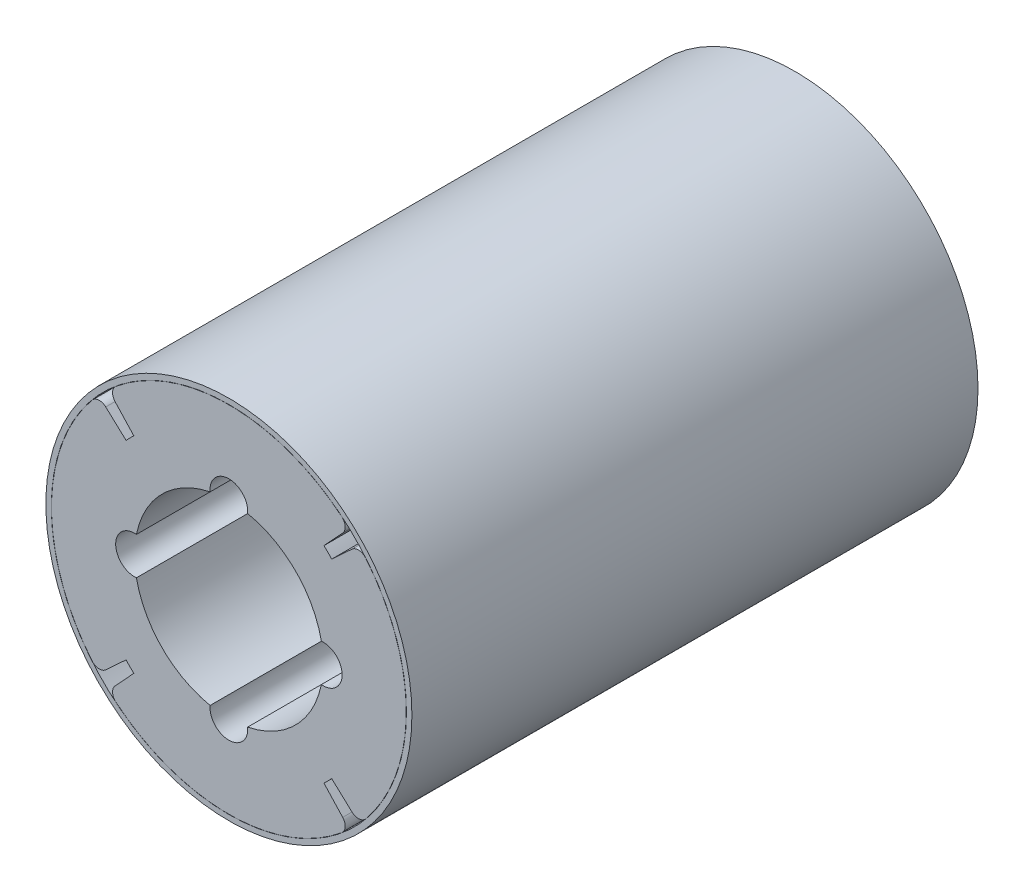
ISO-10303-21;
HEADER;
FILE_DESCRIPTION(('STEP AP214'),'2;1');
FILE_NAME('part.step','',(''),(''),'','','');
FILE_SCHEMA(('AUTOMOTIVE_DESIGN { 1 0 10303 214 1 1 1 1 }'));
ENDSEC;
DATA;
#1=APPLICATION_CONTEXT('core data for automotive mechanical design processes');
#2=APPLICATION_PROTOCOL_DEFINITION('international standard','automotive_design',2000,#1);
#3=PRODUCT_CONTEXT('',#1,'mechanical');
#4=PRODUCT('Part','Part','',(#3));
#5=PRODUCT_RELATED_PRODUCT_CATEGORY('part','',(#4));
#6=PRODUCT_DEFINITION_FORMATION('','',#4);
#7=PRODUCT_DEFINITION_CONTEXT('part definition',#1,'design');
#8=PRODUCT_DEFINITION('design','',#6,#7);
#9=PRODUCT_DEFINITION_SHAPE('','',#8);
#10=(LENGTH_UNIT() NAMED_UNIT(*) SI_UNIT(.MILLI.,.METRE.));
#11=(NAMED_UNIT(*) PLANE_ANGLE_UNIT() SI_UNIT($,.RADIAN.));
#12=(NAMED_UNIT(*) SI_UNIT($,.STERADIAN.) SOLID_ANGLE_UNIT());
#13=UNCERTAINTY_MEASURE_WITH_UNIT(LENGTH_MEASURE(1.E-05),#10,'distance_accuracy_value','');
#14=(GEOMETRIC_REPRESENTATION_CONTEXT(3) GLOBAL_UNCERTAINTY_ASSIGNED_CONTEXT((#13)) GLOBAL_UNIT_ASSIGNED_CONTEXT((#10,
#11,#12)) REPRESENTATION_CONTEXT('',''));
#15=CARTESIAN_POINT('',(0.,0.,0.));
#16=DIRECTION('',(0.,0.,1.));
#17=DIRECTION('',(1.,0.,0.));
#18=AXIS2_PLACEMENT_3D('',#15,#16,#17);
#19=CARTESIAN_POINT('',(0.,0.,30.));
#20=DIRECTION('',(0.,0.,1.));
#21=DIRECTION('',(1.,0.,0.));
#22=AXIS2_PLACEMENT_3D('',#19,#20,#21);
#23=PLANE('',#22);
#24=CARTESIAN_POINT('',(0.,0.,30.));
#25=DIRECTION('',(0.,0.,1.));
#26=DIRECTION('',(1.,0.,0.));
#27=AXIS2_PLACEMENT_3D('',#24,#25,#26);
#28=CIRCLE('',#27,9.7);
#29=CARTESIAN_POINT('',(9.7,0.,30.));
#30=VERTEX_POINT('',#29);
#31=EDGE_CURVE('E11',#30,#30,#28,.T.);
#32=ORIENTED_EDGE('',*,*,#31,.T.);
#33=EDGE_LOOP('',(#32));
#34=FACE_BOUND('',#33,.T.);
#35=CARTESIAN_POINT('',(0.,0.,30.));
#36=DIRECTION('',(0.,0.,1.));
#37=DIRECTION('',(1.,0.,0.));
#38=AXIS2_PLACEMENT_3D('',#35,#36,#37);
#39=CIRCLE('',#38,9.41);
#40=CARTESIAN_POINT('',(9.41,0.,30.));
#41=VERTEX_POINT('',#40);
#42=EDGE_CURVE('E57',#41,#41,#39,.T.);
#43=ORIENTED_EDGE('',*,*,#42,.F.);
#44=EDGE_LOOP('',(#43));
#45=FACE_BOUND('',#44,.T.);
#46=ADVANCED_FACE('F46',(#34,#45),#23,.T.);
#47=CARTESIAN_POINT('',(0.,0.,0.));
#48=DIRECTION('',(0.,0.,1.));
#49=DIRECTION('',(1.,0.,0.));
#50=AXIS2_PLACEMENT_3D('',#47,#48,#49);
#51=PLANE('',#50);
#52=CARTESIAN_POINT('',(0.,0.,0.));
#53=DIRECTION('',(0.,0.,1.));
#54=DIRECTION('',(1.,0.,0.));
#55=AXIS2_PLACEMENT_3D('',#52,#53,#54);
#56=CIRCLE('',#55,9.7);
#57=CARTESIAN_POINT('',(9.7,0.,0.));
#58=VERTEX_POINT('',#57);
#59=EDGE_CURVE('E50',#58,#58,#56,.T.);
#60=ORIENTED_EDGE('',*,*,#59,.F.);
#61=EDGE_LOOP('',(#60));
#62=FACE_BOUND('',#61,.T.);
#63=CARTESIAN_POINT('',(0.,0.,0.));
#64=DIRECTION('',(0.,0.,1.));
#65=DIRECTION('',(1.,0.,0.));
#66=AXIS2_PLACEMENT_3D('',#63,#64,#65);
#67=CIRCLE('',#66,9.41);
#68=CARTESIAN_POINT('',(9.41,0.,0.));
#69=VERTEX_POINT('',#68);
#70=EDGE_CURVE('E59',#69,#69,#67,.T.);
#71=ORIENTED_EDGE('',*,*,#70,.T.);
#72=EDGE_LOOP('',(#71));
#73=FACE_BOUND('',#72,.T.);
#74=ADVANCED_FACE('F69',(#62,#73),#51,.F.);
#75=CARTESIAN_POINT('',(0.,0.,30.));
#76=DIRECTION('',(0.,0.,-1.));
#77=DIRECTION('',(-1.,0.,0.));
#78=AXIS2_PLACEMENT_3D('',#75,#76,#77);
#79=CYLINDRICAL_SURFACE('',#78,9.7);
#80=ORIENTED_EDGE('',*,*,#31,.F.);
#81=EDGE_LOOP('',(#80));
#82=FACE_BOUND('',#81,.T.);
#83=ORIENTED_EDGE('',*,*,#59,.T.);
#84=EDGE_LOOP('',(#83));
#85=FACE_BOUND('',#84,.T.);
#86=ADVANCED_FACE('F48',(#82,#85),#79,.T.);
#87=CARTESIAN_POINT('',(0.,0.,30.));
#88=DIRECTION('',(0.,0.,-1.));
#89=DIRECTION('',(-1.,0.,0.));
#90=AXIS2_PLACEMENT_3D('',#87,#88,#89);
#91=CYLINDRICAL_SURFACE('',#90,9.41);
#92=ORIENTED_EDGE('',*,*,#42,.T.);
#93=EDGE_LOOP('',(#92));
#94=FACE_BOUND('',#93,.T.);
#95=ORIENTED_EDGE('',*,*,#70,.F.);
#96=EDGE_LOOP('',(#95));
#97=FACE_BOUND('',#96,.T.);
#98=ADVANCED_FACE('F65',(#94,#97),#91,.F.);
#99=CLOSED_SHELL('',(#46,#74,#86,#98));
#100=MANIFOLD_SOLID_BREP('B2',#99);
#101=CARTESIAN_POINT('',(0.,0.,30.));
#102=DIRECTION('',(0.,0.,-1.));
#103=DIRECTION('',(-1.,0.,0.));
#104=AXIS2_PLACEMENT_3D('',#101,#102,#103);
#105=CYLINDRICAL_SURFACE('',#104,5.);
#106=CARTESIAN_POINT('',(0.,0.,30.));
#107=DIRECTION('',(0.,0.,1.));
#108=DIRECTION('',(1.,0.,0.));
#109=AXIS2_PLACEMENT_3D('',#106,#107,#108);
#110=CIRCLE('',#109,5.);
#111=CARTESIAN_POINT('',(-0.99498743710662,4.9,30.));
#112=VERTEX_POINT('',#111);
#113=CARTESIAN_POINT('',(-4.9,0.994987437106603,30.));
#114=VERTEX_POINT('',#113);
#115=EDGE_CURVE('E348',#112,#114,#110,.T.);
#116=ORIENTED_EDGE('',*,*,#115,.T.);
#117=DIRECTION('',(0.,0.,-1.));
#118=VECTOR('',#117,1.);
#119=CARTESIAN_POINT('',(-4.9,0.994987437106603,15.));
#120=LINE('',#119,#118);
#121=CARTESIAN_POINT('',(-4.9,0.994987437106603,0.));
#122=VERTEX_POINT('',#121);
#123=EDGE_CURVE('E380',#114,#122,#120,.T.);
#124=ORIENTED_EDGE('',*,*,#123,.T.);
#125=CARTESIAN_POINT('',(0.,0.,0.));
#126=DIRECTION('',(0.,0.,1.));
#127=DIRECTION('',(1.,0.,0.));
#128=AXIS2_PLACEMENT_3D('',#125,#126,#127);
#129=CIRCLE('',#128,5.);
#130=CARTESIAN_POINT('',(-0.99498743710662,4.9,0.));
#131=VERTEX_POINT('',#130);
#132=EDGE_CURVE('E346',#131,#122,#129,.T.);
#133=ORIENTED_EDGE('',*,*,#132,.F.);
#134=DIRECTION('',(0.,0.,-1.));
#135=VECTOR('',#134,1.);
#136=CARTESIAN_POINT('',(-0.99498743710662,4.9,15.));
#137=LINE('',#136,#135);
#138=EDGE_CURVE('E554',#131,#112,#137,.F.);
#139=ORIENTED_EDGE('',*,*,#138,.T.);
#140=EDGE_LOOP('',(#116,#124,#133,#139));
#141=FACE_BOUND('',#140,.T.);
#142=ADVANCED_FACE('F115',(#141),#105,.F.);
#143=CARTESIAN_POINT('',(-4.9,-0.994987437106638,0.));
#144=VERTEX_POINT('',#143);
#145=CARTESIAN_POINT('',(-0.99498743710662,-4.9,0.));
#146=VERTEX_POINT('',#145);
#147=EDGE_CURVE('E351',#144,#146,#129,.T.);
#148=ORIENTED_EDGE('',*,*,#147,.F.);
#149=DIRECTION('',(0.,0.,-1.));
#150=VECTOR('',#149,1.);
#151=CARTESIAN_POINT('',(-4.9,-0.994987437106637,15.));
#152=LINE('',#151,#150);
#153=CARTESIAN_POINT('',(-4.9,-0.994987437106637,30.));
#154=VERTEX_POINT('',#153);
#155=EDGE_CURVE('E370',#144,#154,#152,.F.);
#156=ORIENTED_EDGE('',*,*,#155,.T.);
#157=CARTESIAN_POINT('',(-0.99498743710662,-4.9,30.));
#158=VERTEX_POINT('',#157);
#159=EDGE_CURVE('E349',#154,#158,#110,.T.);
#160=ORIENTED_EDGE('',*,*,#159,.T.);
#161=DIRECTION('',(0.,0.,-1.));
#162=VECTOR('',#161,1.);
#163=CARTESIAN_POINT('',(-0.99498743710662,-4.9,15.));
#164=LINE('',#163,#162);
#165=EDGE_CURVE('E368',#158,#146,#164,.T.);
#166=ORIENTED_EDGE('',*,*,#165,.T.);
#167=EDGE_LOOP('',(#148,#156,#160,#166));
#168=FACE_BOUND('',#167,.T.);
#169=ADVANCED_FACE('F367',(#168),#105,.F.);
#170=CARTESIAN_POINT('',(0.994987437106621,-4.9,0.));
#171=VERTEX_POINT('',#170);
#172=CARTESIAN_POINT('',(4.90000000000001,-0.994987437106569,0.));
#173=VERTEX_POINT('',#172);
#174=EDGE_CURVE('E547',#171,#173,#129,.T.);
#175=ORIENTED_EDGE('',*,*,#174,.F.);
#176=DIRECTION('',(0.,0.,-1.));
#177=VECTOR('',#176,1.);
#178=CARTESIAN_POINT('',(0.99498743710662,-4.9,15.));
#179=LINE('',#178,#177);
#180=CARTESIAN_POINT('',(0.99498743710662,-4.9,30.));
#181=VERTEX_POINT('',#180);
#182=EDGE_CURVE('E138',#171,#181,#179,.F.);
#183=ORIENTED_EDGE('',*,*,#182,.T.);
#184=CARTESIAN_POINT('',(4.90000000000001,-0.994987437106569,30.));
#185=VERTEX_POINT('',#184);
#186=EDGE_CURVE('E345',#181,#185,#110,.T.);
#187=ORIENTED_EDGE('',*,*,#186,.T.);
#188=DIRECTION('',(0.,0.,-1.));
#189=VECTOR('',#188,1.);
#190=CARTESIAN_POINT('',(4.90000000000001,-0.994987437106569,15.));
#191=LINE('',#190,#189);
#192=EDGE_CURVE('E324',#185,#173,#191,.T.);
#193=ORIENTED_EDGE('',*,*,#192,.T.);
#194=EDGE_LOOP('',(#175,#183,#187,#193));
#195=FACE_BOUND('',#194,.T.);
#196=ADVANCED_FACE('F569',(#195),#105,.F.);
#197=CARTESIAN_POINT('',(4.89999999999999,0.994987437106673,0.));
#198=VERTEX_POINT('',#197);
#199=CARTESIAN_POINT('',(0.99498743710662,4.9,0.));
#200=VERTEX_POINT('',#199);
#201=EDGE_CURVE('E337',#198,#200,#129,.T.);
#202=ORIENTED_EDGE('',*,*,#201,.F.);
#203=DIRECTION('',(0.,0.,-1.));
#204=VECTOR('',#203,1.);
#205=CARTESIAN_POINT('',(4.89999999999999,0.994987437106671,15.));
#206=LINE('',#205,#204);
#207=CARTESIAN_POINT('',(4.89999999999999,0.994987437106671,30.));
#208=VERTEX_POINT('',#207);
#209=EDGE_CURVE('E130',#198,#208,#206,.F.);
#210=ORIENTED_EDGE('',*,*,#209,.T.);
#211=CARTESIAN_POINT('',(0.99498743710662,4.9,30.));
#212=VERTEX_POINT('',#211);
#213=EDGE_CURVE('E335',#208,#212,#110,.T.);
#214=ORIENTED_EDGE('',*,*,#213,.T.);
#215=DIRECTION('',(0.,0.,-1.));
#216=VECTOR('',#215,1.);
#217=CARTESIAN_POINT('',(0.99498743710662,4.9,15.));
#218=LINE('',#217,#216);
#219=EDGE_CURVE('E560',#212,#200,#218,.T.);
#220=ORIENTED_EDGE('',*,*,#219,.T.);
#221=EDGE_LOOP('',(#202,#210,#214,#220));
#222=FACE_BOUND('',#221,.T.);
#223=ADVANCED_FACE('F333',(#222),#105,.F.);
#224=CARTESIAN_POINT('',(0.,0.,30.));
#225=DIRECTION('',(0.,0.,-1.));
#226=DIRECTION('',(-1.,0.,0.));
#227=AXIS2_PLACEMENT_3D('',#224,#225,#226);
#228=CYLINDRICAL_SURFACE('',#227,7.42);
#229=DIRECTION('',(0.,0.,-1.));
#230=VECTOR('',#229,1.);
#231=CARTESIAN_POINT('',(5.44867302001283,-5.03670153185438,30.));
#232=LINE('',#231,#230);
#233=CARTESIAN_POINT('',(5.44867302001283,-5.03670153185438,30.));
#234=VERTEX_POINT('',#233);
#235=CARTESIAN_POINT('',(5.44867302001283,-5.03670153185438,0.));
#236=VERTEX_POINT('',#235);
#237=EDGE_CURVE('E423',#234,#236,#232,.T.);
#238=ORIENTED_EDGE('',*,*,#237,.F.);
#239=CARTESIAN_POINT('',(0.,0.,30.));
#240=DIRECTION('',(0.,0.,1.));
#241=DIRECTION('',(1.,0.,0.));
#242=AXIS2_PLACEMENT_3D('',#239,#240,#241);
#243=CIRCLE('',#242,7.42);
#244=CARTESIAN_POINT('',(5.03670153185444,-5.44867302001278,30.));
#245=VERTEX_POINT('',#244);
#246=EDGE_CURVE('E763',#245,#234,#243,.T.);
#247=ORIENTED_EDGE('',*,*,#246,.F.);
#248=DIRECTION('',(0.,0.,-1.));
#249=VECTOR('',#248,1.);
#250=CARTESIAN_POINT('',(5.03670153185444,-5.44867302001278,30.));
#251=LINE('',#250,#249);
#252=CARTESIAN_POINT('',(5.03670153185444,-5.44867302001278,0.));
#253=VERTEX_POINT('',#252);
#254=EDGE_CURVE('E439',#245,#253,#251,.T.);
#255=ORIENTED_EDGE('',*,*,#254,.T.);
#256=CARTESIAN_POINT('',(0.,0.,0.));
#257=DIRECTION('',(0.,0.,1.));
#258=DIRECTION('',(1.,0.,0.));
#259=AXIS2_PLACEMENT_3D('',#256,#257,#258);
#260=CIRCLE('',#259,7.42);
#261=EDGE_CURVE('E359',#253,#236,#260,.T.);
#262=ORIENTED_EDGE('',*,*,#261,.T.);
#263=EDGE_LOOP('',(#238,#247,#255,#262));
#264=FACE_BOUND('',#263,.T.);
#265=ADVANCED_FACE('F576',(#264),#228,.T.);
#266=DIRECTION('',(0.,0.,-1.));
#267=VECTOR('',#266,1.);
#268=CARTESIAN_POINT('',(5.44867302001273,5.03670153185449,30.));
#269=LINE('',#268,#267);
#270=CARTESIAN_POINT('',(5.44867302001273,5.03670153185449,30.));
#271=VERTEX_POINT('',#270);
#272=CARTESIAN_POINT('',(5.44867302001273,5.03670153185449,0.));
#273=VERTEX_POINT('',#272);
#274=EDGE_CURVE('E399',#271,#273,#269,.T.);
#275=ORIENTED_EDGE('',*,*,#274,.T.);
#276=CARTESIAN_POINT('',(5.03670153185444,5.44867302001278,0.));
#277=VERTEX_POINT('',#276);
#278=EDGE_CURVE('E355',#273,#277,#260,.T.);
#279=ORIENTED_EDGE('',*,*,#278,.T.);
#280=DIRECTION('',(0.,0.,-1.));
#281=VECTOR('',#280,1.);
#282=CARTESIAN_POINT('',(5.03670153185444,5.44867302001278,30.));
#283=LINE('',#282,#281);
#284=CARTESIAN_POINT('',(5.03670153185444,5.44867302001278,30.));
#285=VERTEX_POINT('',#284);
#286=EDGE_CURVE('E542',#285,#277,#283,.T.);
#287=ORIENTED_EDGE('',*,*,#286,.F.);
#288=EDGE_CURVE('E556',#271,#285,#243,.T.);
#289=ORIENTED_EDGE('',*,*,#288,.F.);
#290=EDGE_LOOP('',(#275,#279,#287,#289));
#291=FACE_BOUND('',#290,.T.);
#292=ADVANCED_FACE('F764',(#291),#228,.T.);
#293=DIRECTION('',(0.,0.,-1.));
#294=VECTOR('',#293,1.);
#295=CARTESIAN_POINT('',(-5.03670153185444,-5.44867302001278,30.));
#296=LINE('',#295,#294);
#297=CARTESIAN_POINT('',(-5.03670153185444,-5.44867302001278,30.));
#298=VERTEX_POINT('',#297);
#299=CARTESIAN_POINT('',(-5.03670153185444,-5.44867302001278,0.));
#300=VERTEX_POINT('',#299);
#301=EDGE_CURVE('E463',#298,#300,#296,.T.);
#302=ORIENTED_EDGE('',*,*,#301,.F.);
#303=CARTESIAN_POINT('',(-5.44867302001276,-5.03670153185446,30.));
#304=VERTEX_POINT('',#303);
#305=EDGE_CURVE('E555',#304,#298,#243,.T.);
#306=ORIENTED_EDGE('',*,*,#305,.F.);
#307=DIRECTION('',(0.,0.,-1.));
#308=VECTOR('',#307,1.);
#309=CARTESIAN_POINT('',(-5.44867302001276,-5.03670153185445,30.));
#310=LINE('',#309,#308);
#311=CARTESIAN_POINT('',(-5.44867302001276,-5.03670153185445,0.));
#312=VERTEX_POINT('',#311);
#313=EDGE_CURVE('E479',#304,#312,#310,.T.);
#314=ORIENTED_EDGE('',*,*,#313,.T.);
#315=EDGE_CURVE('E558',#312,#300,#260,.T.);
#316=ORIENTED_EDGE('',*,*,#315,.T.);
#317=EDGE_LOOP('',(#302,#306,#314,#316));
#318=FACE_BOUND('',#317,.T.);
#319=ADVANCED_FACE('F799',(#318),#228,.T.);
#320=DIRECTION('',(0.,0.,-1.));
#321=VECTOR('',#320,1.);
#322=CARTESIAN_POINT('',(-5.4486730200128,5.03670153185442,30.));
#323=LINE('',#322,#321);
#324=CARTESIAN_POINT('',(-5.4486730200128,5.03670153185442,30.));
#325=VERTEX_POINT('',#324);
#326=CARTESIAN_POINT('',(-5.4486730200128,5.03670153185442,0.));
#327=VERTEX_POINT('',#326);
#328=EDGE_CURVE('E503',#325,#327,#323,.T.);
#329=ORIENTED_EDGE('',*,*,#328,.F.);
#330=CARTESIAN_POINT('',(-5.03670153185444,5.44867302001278,30.));
#331=VERTEX_POINT('',#330);
#332=EDGE_CURVE('E552',#331,#325,#243,.T.);
#333=ORIENTED_EDGE('',*,*,#332,.F.);
#334=DIRECTION('',(0.,0.,-1.));
#335=VECTOR('',#334,1.);
#336=CARTESIAN_POINT('',(-5.03670153185444,5.44867302001278,30.));
#337=LINE('',#336,#335);
#338=CARTESIAN_POINT('',(-5.03670153185444,5.44867302001278,0.));
#339=VERTEX_POINT('',#338);
#340=EDGE_CURVE('E519',#331,#339,#337,.T.);
#341=ORIENTED_EDGE('',*,*,#340,.T.);
#342=EDGE_CURVE('E361',#339,#327,#260,.T.);
#343=ORIENTED_EDGE('',*,*,#342,.T.);
#344=EDGE_LOOP('',(#329,#333,#341,#343));
#345=FACE_BOUND('',#344,.T.);
#346=ADVANCED_FACE('F117',(#345),#228,.T.);
#347=CARTESIAN_POINT('',(0.,0.,30.));
#348=DIRECTION('',(0.,0.,1.));
#349=DIRECTION('',(1.,0.,0.));
#350=AXIS2_PLACEMENT_3D('',#347,#348,#349);
#351=PLANE('',#350);
#352=ORIENTED_EDGE('',*,*,#332,.T.);
#353=DIRECTION('',(-0.734322509435687,0.67880074553294,0.));
#354=VECTOR('',#353,1.);
#355=CARTESIAN_POINT('',(-5.4486730200128,5.03670153185442,30.));
#356=LINE('',#355,#354);
#357=CARTESIAN_POINT('',(-6.52514866492216,6.03178538251026,30.));
#358=VERTEX_POINT('',#357);
#359=EDGE_CURVE('E467',#325,#358,#356,.T.);
#360=ORIENTED_EDGE('',*,*,#359,.T.);
#361=CARTESIAN_POINT('',(-6.86454903768863,5.66462412779242,30.));
#362=DIRECTION('',(0.,0.,1.));
#363=DIRECTION('',(0.,1.,0.));
#364=AXIS2_PLACEMENT_3D('',#361,#362,#363);
#365=CIRCLE('',#364,0.499999999999999);
#366=CARTESIAN_POINT('',(-7.25019786003069,5.98286143834256,30.));
#367=VERTEX_POINT('',#366);
#368=EDGE_CURVE('E469',#358,#367,#365,.T.);
#369=ORIENTED_EDGE('',*,*,#368,.T.);
#370=CARTESIAN_POINT('',(0.,0.,30.));
#371=DIRECTION('',(0.,0.,1.));
#372=DIRECTION('',(0.,-1.,0.));
#373=AXIS2_PLACEMENT_3D('',#370,#371,#372);
#374=CIRCLE('',#373,9.4);
#375=CARTESIAN_POINT('',(-7.25019786003065,-5.98286143834261,30.));
#376=VERTEX_POINT('',#375);
#377=EDGE_CURVE('E472',#367,#376,#374,.T.);
#378=ORIENTED_EDGE('',*,*,#377,.T.);
#379=CARTESIAN_POINT('',(-6.86454903768859,-5.66462412779247,30.));
#380=DIRECTION('',(0.,0.,1.));
#381=DIRECTION('',(0.,-1.,0.));
#382=AXIS2_PLACEMENT_3D('',#379,#380,#381);
#383=CIRCLE('',#382,0.499999999999999);
#384=CARTESIAN_POINT('',(-6.52514866492212,-6.03178538251031,30.));
#385=VERTEX_POINT('',#384);
#386=EDGE_CURVE('E474',#376,#385,#383,.T.);
#387=ORIENTED_EDGE('',*,*,#386,.T.);
#388=DIRECTION('',(0.734322509435683,0.678800745532945,0.));
#389=VECTOR('',#388,1.);
#390=CARTESIAN_POINT('',(-5.44867302001276,-5.03670153185445,30.));
#391=LINE('',#390,#389);
#392=EDGE_CURVE('E476',#385,#304,#391,.T.);
#393=ORIENTED_EDGE('',*,*,#392,.T.);
#394=ORIENTED_EDGE('',*,*,#305,.T.);
#395=DIRECTION('',(-0.678800745532942,-0.734322509435685,0.));
#396=VECTOR('',#395,1.);
#397=CARTESIAN_POINT('',(-5.03670153185444,-5.44867302001278,30.));
#398=LINE('',#397,#396);
#399=CARTESIAN_POINT('',(-6.03178538251029,-6.52514866492214,30.));
#400=VERTEX_POINT('',#399);
#401=EDGE_CURVE('E427',#298,#400,#398,.T.);
#402=ORIENTED_EDGE('',*,*,#401,.T.);
#403=CARTESIAN_POINT('',(-5.66462412779245,-6.86454903768861,30.));
#404=DIRECTION('',(0.,0.,1.));
#405=DIRECTION('',(-1.,0.,0.));
#406=AXIS2_PLACEMENT_3D('',#403,#404,#405);
#407=CIRCLE('',#406,0.499999999999999);
#408=CARTESIAN_POINT('',(-5.98286143834258,-7.25019786003067,30.));
#409=VERTEX_POINT('',#408);
#410=EDGE_CURVE('E429',#400,#409,#407,.T.);
#411=ORIENTED_EDGE('',*,*,#410,.T.);
#412=CARTESIAN_POINT('',(0.,0.,30.));
#413=DIRECTION('',(0.,0.,1.));
#414=DIRECTION('',(1.,0.,0.));
#415=AXIS2_PLACEMENT_3D('',#412,#413,#414);
#416=CIRCLE('',#415,9.4);
#417=CARTESIAN_POINT('',(5.98286143834258,-7.25019786003067,30.));
#418=VERTEX_POINT('',#417);
#419=EDGE_CURVE('E432',#409,#418,#416,.T.);
#420=ORIENTED_EDGE('',*,*,#419,.T.);
#421=CARTESIAN_POINT('',(5.66462412779245,-6.86454903768861,30.));
#422=DIRECTION('',(0.,0.,1.));
#423=DIRECTION('',(1.,0.,0.));
#424=AXIS2_PLACEMENT_3D('',#421,#422,#423);
#425=CIRCLE('',#424,0.499999999999999);
#426=CARTESIAN_POINT('',(6.03178538251029,-6.52514866492214,30.));
#427=VERTEX_POINT('',#426);
#428=EDGE_CURVE('E434',#418,#427,#425,.T.);
#429=ORIENTED_EDGE('',*,*,#428,.T.);
#430=DIRECTION('',(-0.678800745532942,0.734322509435685,0.));
#431=VECTOR('',#430,1.);
#432=CARTESIAN_POINT('',(5.03670153185444,-5.44867302001278,30.));
#433=LINE('',#432,#431);
#434=EDGE_CURVE('E436',#427,#245,#433,.T.);
#435=ORIENTED_EDGE('',*,*,#434,.T.);
#436=ORIENTED_EDGE('',*,*,#246,.T.);
#437=DIRECTION('',(0.734322509435692,-0.678800745532935,0.));
#438=VECTOR('',#437,1.);
#439=CARTESIAN_POINT('',(5.44867302001283,-5.03670153185438,30.));
#440=LINE('',#439,#438);
#441=CARTESIAN_POINT('',(6.5251486649222,-6.03178538251022,30.));
#442=VERTEX_POINT('',#441);
#443=EDGE_CURVE('E387',#234,#442,#440,.T.);
#444=ORIENTED_EDGE('',*,*,#443,.T.);
#445=CARTESIAN_POINT('',(6.86454903768867,-5.66462412779237,30.));
#446=DIRECTION('',(0.,0.,1.));
#447=DIRECTION('',(0.,-1.,0.));
#448=AXIS2_PLACEMENT_3D('',#445,#446,#447);
#449=CIRCLE('',#448,0.499999999999999);
#450=CARTESIAN_POINT('',(7.25019786003073,-5.98286143834251,30.));
#451=VERTEX_POINT('',#450);
#452=EDGE_CURVE('E389',#442,#451,#449,.T.);
#453=ORIENTED_EDGE('',*,*,#452,.T.);
#454=CARTESIAN_POINT('',(0.,0.,30.));
#455=DIRECTION('',(0.,0.,1.));
#456=DIRECTION('',(0.,1.,0.));
#457=AXIS2_PLACEMENT_3D('',#454,#455,#456);
#458=CIRCLE('',#457,9.4);
#459=CARTESIAN_POINT('',(7.25019786003061,5.98286143834266,30.));
#460=VERTEX_POINT('',#459);
#461=EDGE_CURVE('E392',#451,#460,#458,.T.);
#462=ORIENTED_EDGE('',*,*,#461,.T.);
#463=CARTESIAN_POINT('',(6.86454903768855,5.66462412779252,30.));
#464=DIRECTION('',(0.,0.,1.));
#465=DIRECTION('',(0.,1.,0.));
#466=AXIS2_PLACEMENT_3D('',#463,#464,#465);
#467=CIRCLE('',#466,0.499999999999999);
#468=CARTESIAN_POINT('',(6.52514866492208,6.03178538251036,30.));
#469=VERTEX_POINT('',#468);
#470=EDGE_CURVE('E394',#460,#469,#467,.T.);
#471=ORIENTED_EDGE('',*,*,#470,.T.);
#472=DIRECTION('',(-0.734322509435678,-0.67880074553295,0.));
#473=VECTOR('',#472,1.);
#474=CARTESIAN_POINT('',(5.44867302001273,5.03670153185449,30.));
#475=LINE('',#474,#473);
#476=EDGE_CURVE('E396',#469,#271,#475,.T.);
#477=ORIENTED_EDGE('',*,*,#476,.T.);
#478=ORIENTED_EDGE('',*,*,#288,.T.);
#479=DIRECTION('',(0.678800745532942,0.734322509435685,0.));
#480=VECTOR('',#479,1.);
#481=CARTESIAN_POINT('',(5.03670153185444,5.44867302001278,30.));
#482=LINE('',#481,#480);
#483=CARTESIAN_POINT('',(6.03178538251029,6.52514866492214,30.));
#484=VERTEX_POINT('',#483);
#485=EDGE_CURVE('E507',#285,#484,#482,.T.);
#486=ORIENTED_EDGE('',*,*,#485,.T.);
#487=CARTESIAN_POINT('',(5.66462412779245,6.86454903768861,30.));
#488=DIRECTION('',(0.,0.,1.));
#489=DIRECTION('',(1.,0.,0.));
#490=AXIS2_PLACEMENT_3D('',#487,#488,#489);
#491=CIRCLE('',#490,0.499999999999999);
#492=CARTESIAN_POINT('',(5.98286143834258,7.25019786003067,30.));
#493=VERTEX_POINT('',#492);
#494=EDGE_CURVE('E509',#484,#493,#491,.T.);
#495=ORIENTED_EDGE('',*,*,#494,.T.);
#496=CARTESIAN_POINT('',(0.,0.,30.));
#497=DIRECTION('',(0.,0.,1.));
#498=DIRECTION('',(-1.,0.,0.));
#499=AXIS2_PLACEMENT_3D('',#496,#497,#498);
#500=CIRCLE('',#499,9.4);
#501=CARTESIAN_POINT('',(-5.98286143834258,7.25019786003067,30.));
#502=VERTEX_POINT('',#501);
#503=EDGE_CURVE('E512',#493,#502,#500,.T.);
#504=ORIENTED_EDGE('',*,*,#503,.T.);
#505=CARTESIAN_POINT('',(-5.66462412779245,6.86454903768861,30.));
#506=DIRECTION('',(0.,0.,1.));
#507=DIRECTION('',(-1.,0.,0.));
#508=AXIS2_PLACEMENT_3D('',#505,#506,#507);
#509=CIRCLE('',#508,0.499999999999999);
#510=CARTESIAN_POINT('',(-6.03178538251029,6.52514866492214,30.));
#511=VERTEX_POINT('',#510);
#512=EDGE_CURVE('E514',#502,#511,#509,.T.);
#513=ORIENTED_EDGE('',*,*,#512,.T.);
#514=DIRECTION('',(0.678800745532942,-0.734322509435685,0.));
#515=VECTOR('',#514,1.);
#516=CARTESIAN_POINT('',(-5.03670153185444,5.44867302001278,30.));
#517=LINE('',#516,#515);
#518=EDGE_CURVE('E516',#511,#331,#517,.T.);
#519=ORIENTED_EDGE('',*,*,#518,.T.);
#520=EDGE_LOOP('',(#352,#360,#369,#378,#387,#393,#394,#402,#411,#420,#429,#435,#436,#444,#453,
#462,#471,#477,#478,#486,#495,#504,#513,#519));
#521=FACE_BOUND('',#520,.T.);
#522=ORIENTED_EDGE('',*,*,#159,.F.);
#523=CARTESIAN_POINT('',(-5.,0.,30.));
#524=DIRECTION('',(0.,0.,1.));
#525=DIRECTION('',(0.,1.,0.));
#526=AXIS2_PLACEMENT_3D('',#523,#524,#525);
#527=CIRCLE('',#526,1.);
#528=EDGE_CURVE('E338',#114,#154,#527,.T.);
#529=ORIENTED_EDGE('',*,*,#528,.F.);
#530=ORIENTED_EDGE('',*,*,#115,.F.);
#531=CARTESIAN_POINT('',(0.,5.,30.));
#532=DIRECTION('',(0.,0.,1.));
#533=DIRECTION('',(1.,0.,0.));
#534=AXIS2_PLACEMENT_3D('',#531,#532,#533);
#535=CIRCLE('',#534,1.);
#536=EDGE_CURVE('E344',#212,#112,#535,.T.);
#537=ORIENTED_EDGE('',*,*,#536,.F.);
#538=ORIENTED_EDGE('',*,*,#213,.F.);
#539=CARTESIAN_POINT('',(5.,0.,30.));
#540=DIRECTION('',(0.,0.,1.));
#541=DIRECTION('',(0.,-1.,0.));
#542=AXIS2_PLACEMENT_3D('',#539,#540,#541);
#543=CIRCLE('',#542,1.);
#544=EDGE_CURVE('E321',#185,#208,#543,.T.);
#545=ORIENTED_EDGE('',*,*,#544,.F.);
#546=ORIENTED_EDGE('',*,*,#186,.F.);
#547=CARTESIAN_POINT('',(0.,-5.,30.));
#548=DIRECTION('',(0.,0.,1.));
#549=DIRECTION('',(-1.,0.,0.));
#550=AXIS2_PLACEMENT_3D('',#547,#548,#549);
#551=CIRCLE('',#550,1.);
#552=EDGE_CURVE('E329',#158,#181,#551,.T.);
#553=ORIENTED_EDGE('',*,*,#552,.F.);
#554=EDGE_LOOP('',(#522,#529,#530,#537,#538,#545,#546,#553));
#555=FACE_BOUND('',#554,.T.);
#556=ADVANCED_FACE('F342',(#521,#555),#351,.T.);
#557=CARTESIAN_POINT('',(0.,0.,0.));
#558=DIRECTION('',(0.,0.,1.));
#559=DIRECTION('',(1.,0.,0.));
#560=AXIS2_PLACEMENT_3D('',#557,#558,#559);
#561=PLANE('',#560);
#562=CARTESIAN_POINT('',(-5.,0.,0.));
#563=DIRECTION('',(0.,0.,1.));
#564=DIRECTION('',(1.,0.,0.));
#565=AXIS2_PLACEMENT_3D('',#562,#563,#564);
#566=CIRCLE('',#565,1.);
#567=EDGE_CURVE('E44',#144,#122,#566,.F.);
#568=ORIENTED_EDGE('',*,*,#567,.F.);
#569=ORIENTED_EDGE('',*,*,#147,.T.);
#570=CARTESIAN_POINT('',(0.,-5.,0.));
#571=DIRECTION('',(0.,0.,1.));
#572=DIRECTION('',(1.,0.,0.));
#573=AXIS2_PLACEMENT_3D('',#570,#571,#572);
#574=CIRCLE('',#573,1.);
#575=EDGE_CURVE('E123',#171,#146,#574,.F.);
#576=ORIENTED_EDGE('',*,*,#575,.F.);
#577=ORIENTED_EDGE('',*,*,#174,.T.);
#578=CARTESIAN_POINT('',(5.,0.,0.));
#579=DIRECTION('',(0.,0.,1.));
#580=DIRECTION('',(1.,0.,0.));
#581=AXIS2_PLACEMENT_3D('',#578,#579,#580);
#582=CIRCLE('',#581,1.);
#583=EDGE_CURVE('E562',#198,#173,#582,.F.);
#584=ORIENTED_EDGE('',*,*,#583,.F.);
#585=ORIENTED_EDGE('',*,*,#201,.T.);
#586=CARTESIAN_POINT('',(0.,5.,0.));
#587=DIRECTION('',(0.,0.,1.));
#588=DIRECTION('',(1.,0.,0.));
#589=AXIS2_PLACEMENT_3D('',#586,#587,#588);
#590=CIRCLE('',#589,1.);
#591=EDGE_CURVE('E382',#200,#131,#590,.T.);
#592=ORIENTED_EDGE('',*,*,#591,.T.);
#593=ORIENTED_EDGE('',*,*,#132,.T.);
#594=EDGE_LOOP('',(#568,#569,#576,#577,#584,#585,#592,#593));
#595=FACE_BOUND('',#594,.T.);
#596=ORIENTED_EDGE('',*,*,#342,.F.);
#597=DIRECTION('',(0.678800745532942,-0.734322509435685,0.));
#598=VECTOR('',#597,1.);
#599=CARTESIAN_POINT('',(-5.03670153185444,5.44867302001278,0.));
#600=LINE('',#599,#598);
#601=CARTESIAN_POINT('',(-6.03178538251029,6.52514866492214,0.));
#602=VERTEX_POINT('',#601);
#603=EDGE_CURVE('E510',#602,#339,#600,.T.);
#604=ORIENTED_EDGE('',*,*,#603,.F.);
#605=CARTESIAN_POINT('',(-5.66462412779245,6.86454903768861,0.));
#606=DIRECTION('',(0.,0.,1.));
#607=DIRECTION('',(-1.,0.,0.));
#608=AXIS2_PLACEMENT_3D('',#605,#606,#607);
#609=CIRCLE('',#608,0.499999999999999);
#610=CARTESIAN_POINT('',(-5.98286143834258,7.25019786003067,0.));
#611=VERTEX_POINT('',#610);
#612=EDGE_CURVE('E525',#611,#602,#609,.T.);
#613=ORIENTED_EDGE('',*,*,#612,.F.);
#614=CARTESIAN_POINT('',(0.,0.,0.));
#615=DIRECTION('',(0.,0.,1.));
#616=DIRECTION('',(-1.,0.,0.));
#617=AXIS2_PLACEMENT_3D('',#614,#615,#616);
#618=CIRCLE('',#617,9.4);
#619=CARTESIAN_POINT('',(5.98286143834258,7.25019786003067,0.));
#620=VERTEX_POINT('',#619);
#621=EDGE_CURVE('E523',#620,#611,#618,.T.);
#622=ORIENTED_EDGE('',*,*,#621,.F.);
#623=CARTESIAN_POINT('',(5.66462412779245,6.86454903768861,0.));
#624=DIRECTION('',(0.,0.,1.));
#625=DIRECTION('',(1.,0.,0.));
#626=AXIS2_PLACEMENT_3D('',#623,#624,#625);
#627=CIRCLE('',#626,0.499999999999999);
#628=CARTESIAN_POINT('',(6.03178538251029,6.52514866492214,0.));
#629=VERTEX_POINT('',#628);
#630=EDGE_CURVE('E521',#629,#620,#627,.T.);
#631=ORIENTED_EDGE('',*,*,#630,.F.);
#632=DIRECTION('',(0.678800745532942,0.734322509435685,0.));
#633=VECTOR('',#632,1.);
#634=CARTESIAN_POINT('',(5.03670153185444,5.44867302001278,0.));
#635=LINE('',#634,#633);
#636=EDGE_CURVE('E506',#277,#629,#635,.T.);
#637=ORIENTED_EDGE('',*,*,#636,.F.);
#638=ORIENTED_EDGE('',*,*,#278,.F.);
#639=DIRECTION('',(-0.734322509435678,-0.67880074553295,0.));
#640=VECTOR('',#639,1.);
#641=CARTESIAN_POINT('',(5.44867302001273,5.03670153185449,0.));
#642=LINE('',#641,#640);
#643=CARTESIAN_POINT('',(6.52514866492208,6.03178538251036,0.));
#644=VERTEX_POINT('',#643);
#645=EDGE_CURVE('E390',#644,#273,#642,.T.);
#646=ORIENTED_EDGE('',*,*,#645,.F.);
#647=CARTESIAN_POINT('',(6.86454903768855,5.66462412779252,0.));
#648=DIRECTION('',(0.,0.,1.));
#649=DIRECTION('',(0.,1.,0.));
#650=AXIS2_PLACEMENT_3D('',#647,#648,#649);
#651=CIRCLE('',#650,0.499999999999999);
#652=CARTESIAN_POINT('',(7.25019786003061,5.98286143834266,0.));
#653=VERTEX_POINT('',#652);
#654=EDGE_CURVE('E405',#653,#644,#651,.T.);
#655=ORIENTED_EDGE('',*,*,#654,.F.);
#656=CARTESIAN_POINT('',(0.,0.,0.));
#657=DIRECTION('',(0.,0.,1.));
#658=DIRECTION('',(0.,1.,0.));
#659=AXIS2_PLACEMENT_3D('',#656,#657,#658);
#660=CIRCLE('',#659,9.4);
#661=CARTESIAN_POINT('',(7.25019786003073,-5.98286143834251,0.));
#662=VERTEX_POINT('',#661);
#663=EDGE_CURVE('E403',#662,#653,#660,.T.);
#664=ORIENTED_EDGE('',*,*,#663,.F.);
#665=CARTESIAN_POINT('',(6.86454903768867,-5.66462412779237,0.));
#666=DIRECTION('',(0.,0.,1.));
#667=DIRECTION('',(0.,-1.,0.));
#668=AXIS2_PLACEMENT_3D('',#665,#666,#667);
#669=CIRCLE('',#668,0.499999999999999);
#670=CARTESIAN_POINT('',(6.5251486649222,-6.03178538251022,0.));
#671=VERTEX_POINT('',#670);
#672=EDGE_CURVE('E401',#671,#662,#669,.T.);
#673=ORIENTED_EDGE('',*,*,#672,.F.);
#674=DIRECTION('',(0.734322509435692,-0.678800745532935,0.));
#675=VECTOR('',#674,1.);
#676=CARTESIAN_POINT('',(5.44867302001283,-5.03670153185438,0.));
#677=LINE('',#676,#675);
#678=EDGE_CURVE('E384',#236,#671,#677,.T.);
#679=ORIENTED_EDGE('',*,*,#678,.F.);
#680=ORIENTED_EDGE('',*,*,#261,.F.);
#681=DIRECTION('',(-0.678800745532942,0.734322509435685,0.));
#682=VECTOR('',#681,1.);
#683=CARTESIAN_POINT('',(5.03670153185444,-5.44867302001278,0.));
#684=LINE('',#683,#682);
#685=CARTESIAN_POINT('',(6.03178538251029,-6.52514866492214,0.));
#686=VERTEX_POINT('',#685);
#687=EDGE_CURVE('E430',#686,#253,#684,.T.);
#688=ORIENTED_EDGE('',*,*,#687,.F.);
#689=CARTESIAN_POINT('',(5.66462412779245,-6.86454903768861,0.));
#690=DIRECTION('',(0.,0.,1.));
#691=DIRECTION('',(1.,0.,0.));
#692=AXIS2_PLACEMENT_3D('',#689,#690,#691);
#693=CIRCLE('',#692,0.499999999999999);
#694=CARTESIAN_POINT('',(5.98286143834258,-7.25019786003067,0.));
#695=VERTEX_POINT('',#694);
#696=EDGE_CURVE('E445',#695,#686,#693,.T.);
#697=ORIENTED_EDGE('',*,*,#696,.F.);
#698=CARTESIAN_POINT('',(0.,0.,0.));
#699=DIRECTION('',(0.,0.,1.));
#700=DIRECTION('',(1.,0.,0.));
#701=AXIS2_PLACEMENT_3D('',#698,#699,#700);
#702=CIRCLE('',#701,9.4);
#703=CARTESIAN_POINT('',(-5.98286143834258,-7.25019786003067,0.));
#704=VERTEX_POINT('',#703);
#705=EDGE_CURVE('E443',#704,#695,#702,.T.);
#706=ORIENTED_EDGE('',*,*,#705,.F.);
#707=CARTESIAN_POINT('',(-5.66462412779245,-6.86454903768861,0.));
#708=DIRECTION('',(0.,0.,1.));
#709=DIRECTION('',(-1.,0.,0.));
#710=AXIS2_PLACEMENT_3D('',#707,#708,#709);
#711=CIRCLE('',#710,0.499999999999999);
#712=CARTESIAN_POINT('',(-6.03178538251029,-6.52514866492214,0.));
#713=VERTEX_POINT('',#712);
#714=EDGE_CURVE('E441',#713,#704,#711,.T.);
#715=ORIENTED_EDGE('',*,*,#714,.F.);
#716=DIRECTION('',(-0.678800745532942,-0.734322509435685,0.));
#717=VECTOR('',#716,1.);
#718=CARTESIAN_POINT('',(-5.03670153185444,-5.44867302001278,0.));
#719=LINE('',#718,#717);
#720=EDGE_CURVE('E426',#300,#713,#719,.T.);
#721=ORIENTED_EDGE('',*,*,#720,.F.);
#722=ORIENTED_EDGE('',*,*,#315,.F.);
#723=DIRECTION('',(0.734322509435683,0.678800745532945,0.));
#724=VECTOR('',#723,1.);
#725=CARTESIAN_POINT('',(-5.44867302001276,-5.03670153185445,0.));
#726=LINE('',#725,#724);
#727=CARTESIAN_POINT('',(-6.52514866492212,-6.03178538251031,0.));
#728=VERTEX_POINT('',#727);
#729=EDGE_CURVE('E470',#728,#312,#726,.T.);
#730=ORIENTED_EDGE('',*,*,#729,.F.);
#731=CARTESIAN_POINT('',(-6.86454903768859,-5.66462412779247,0.));
#732=DIRECTION('',(0.,0.,1.));
#733=DIRECTION('',(0.,-1.,0.));
#734=AXIS2_PLACEMENT_3D('',#731,#732,#733);
#735=CIRCLE('',#734,0.499999999999999);
#736=CARTESIAN_POINT('',(-7.25019786003065,-5.98286143834261,0.));
#737=VERTEX_POINT('',#736);
#738=EDGE_CURVE('E485',#737,#728,#735,.T.);
#739=ORIENTED_EDGE('',*,*,#738,.F.);
#740=CARTESIAN_POINT('',(0.,0.,0.));
#741=DIRECTION('',(0.,0.,1.));
#742=DIRECTION('',(0.,-1.,0.));
#743=AXIS2_PLACEMENT_3D('',#740,#741,#742);
#744=CIRCLE('',#743,9.4);
#745=CARTESIAN_POINT('',(-7.25019786003069,5.98286143834256,0.));
#746=VERTEX_POINT('',#745);
#747=EDGE_CURVE('E483',#746,#737,#744,.T.);
#748=ORIENTED_EDGE('',*,*,#747,.F.);
#749=CARTESIAN_POINT('',(-6.86454903768863,5.66462412779242,0.));
#750=DIRECTION('',(0.,0.,1.));
#751=DIRECTION('',(0.,1.,0.));
#752=AXIS2_PLACEMENT_3D('',#749,#750,#751);
#753=CIRCLE('',#752,0.499999999999999);
#754=CARTESIAN_POINT('',(-6.52514866492216,6.03178538251026,0.));
#755=VERTEX_POINT('',#754);
#756=EDGE_CURVE('E481',#755,#746,#753,.T.);
#757=ORIENTED_EDGE('',*,*,#756,.F.);
#758=DIRECTION('',(-0.734322509435687,0.67880074553294,0.));
#759=VECTOR('',#758,1.);
#760=CARTESIAN_POINT('',(-5.4486730200128,5.03670153185442,0.));
#761=LINE('',#760,#759);
#762=EDGE_CURVE('E466',#327,#755,#761,.T.);
#763=ORIENTED_EDGE('',*,*,#762,.F.);
#764=EDGE_LOOP('',(#596,#604,#613,#622,#631,#637,#638,#646,#655,#664,#673,#679,#680,#688,#697,
#706,#715,#721,#722,#730,#739,#748,#757,#763));
#765=FACE_BOUND('',#764,.T.);
#766=ADVANCED_FACE('F566',(#595,#765),#561,.F.);
#767=CARTESIAN_POINT('',(5.03670153185444,5.44867302001278,30.));
#768=DIRECTION('',(-0.734322509435685,0.678800745532942,0.));
#769=DIRECTION('',(-0.678800745532942,-0.734322509435685,0.));
#770=AXIS2_PLACEMENT_3D('',#767,#768,#769);
#771=PLANE('',#770);
#772=ORIENTED_EDGE('',*,*,#636,.T.);
#773=DIRECTION('',(0.,0.,-1.));
#774=VECTOR('',#773,1.);
#775=CARTESIAN_POINT('',(6.03178538251029,6.52514866492214,30.));
#776=LINE('',#775,#774);
#777=EDGE_CURVE('E540',#484,#629,#776,.T.);
#778=ORIENTED_EDGE('',*,*,#777,.F.);
#779=ORIENTED_EDGE('',*,*,#485,.F.);
#780=ORIENTED_EDGE('',*,*,#286,.T.);
#781=EDGE_LOOP('',(#772,#778,#779,#780));
#782=FACE_BOUND('',#781,.T.);
#783=ADVANCED_FACE('F621',(#782),#771,.F.);
#784=CARTESIAN_POINT('',(5.66462412779245,6.86454903768861,30.));
#785=DIRECTION('',(0.,0.,-1.));
#786=DIRECTION('',(-1.,0.,0.));
#787=AXIS2_PLACEMENT_3D('',#784,#785,#786);
#788=CYLINDRICAL_SURFACE('',#787,0.499999999999999);
#789=ORIENTED_EDGE('',*,*,#630,.T.);
#790=DIRECTION('',(0.,0.,-1.));
#791=VECTOR('',#790,1.);
#792=CARTESIAN_POINT('',(5.98286143834258,7.25019786003067,30.));
#793=LINE('',#792,#791);
#794=EDGE_CURVE('E537',#493,#620,#793,.T.);
#795=ORIENTED_EDGE('',*,*,#794,.F.);
#796=ORIENTED_EDGE('',*,*,#494,.F.);
#797=ORIENTED_EDGE('',*,*,#777,.T.);
#798=EDGE_LOOP('',(#789,#795,#796,#797));
#799=FACE_BOUND('',#798,.T.);
#800=ADVANCED_FACE('F740',(#799),#788,.T.);
#801=CARTESIAN_POINT('',(0.,0.,30.));
#802=DIRECTION('',(0.,0.,-1.));
#803=DIRECTION('',(-1.,0.,0.));
#804=AXIS2_PLACEMENT_3D('',#801,#802,#803);
#805=CYLINDRICAL_SURFACE('',#804,9.4);
#806=ORIENTED_EDGE('',*,*,#621,.T.);
#807=DIRECTION('',(0.,0.,-1.));
#808=VECTOR('',#807,1.);
#809=CARTESIAN_POINT('',(-5.98286143834258,7.25019786003067,30.));
#810=LINE('',#809,#808);
#811=EDGE_CURVE('E534',#502,#611,#810,.T.);
#812=ORIENTED_EDGE('',*,*,#811,.F.);
#813=ORIENTED_EDGE('',*,*,#503,.F.);
#814=ORIENTED_EDGE('',*,*,#794,.T.);
#815=EDGE_LOOP('',(#806,#812,#813,#814));
#816=FACE_BOUND('',#815,.T.);
#817=ADVANCED_FACE('F736',(#816),#805,.T.);
#818=CARTESIAN_POINT('',(-5.66462412779245,6.86454903768861,30.));
#819=DIRECTION('',(0.,0.,-1.));
#820=DIRECTION('',(-1.,0.,0.));
#821=AXIS2_PLACEMENT_3D('',#818,#819,#820);
#822=CYLINDRICAL_SURFACE('',#821,0.499999999999999);
#823=ORIENTED_EDGE('',*,*,#612,.T.);
#824=DIRECTION('',(0.,0.,-1.));
#825=VECTOR('',#824,1.);
#826=CARTESIAN_POINT('',(-6.03178538251029,6.52514866492214,30.));
#827=LINE('',#826,#825);
#828=EDGE_CURVE('E531',#511,#602,#827,.T.);
#829=ORIENTED_EDGE('',*,*,#828,.F.);
#830=ORIENTED_EDGE('',*,*,#512,.F.);
#831=ORIENTED_EDGE('',*,*,#811,.T.);
#832=EDGE_LOOP('',(#823,#829,#830,#831));
#833=FACE_BOUND('',#832,.T.);
#834=ADVANCED_FACE('F732',(#833),#822,.T.);
#835=CARTESIAN_POINT('',(-5.03670153185444,5.44867302001278,30.));
#836=DIRECTION('',(0.734322509435685,0.678800745532942,0.));
#837=DIRECTION('',(-0.678800745532942,0.734322509435685,0.));
#838=AXIS2_PLACEMENT_3D('',#835,#836,#837);
#839=PLANE('',#838);
#840=ORIENTED_EDGE('',*,*,#603,.T.);
#841=ORIENTED_EDGE('',*,*,#340,.F.);
#842=ORIENTED_EDGE('',*,*,#518,.F.);
#843=ORIENTED_EDGE('',*,*,#828,.T.);
#844=EDGE_LOOP('',(#840,#841,#842,#843));
#845=FACE_BOUND('',#844,.T.);
#846=ADVANCED_FACE('F728',(#845),#839,.F.);
#847=CARTESIAN_POINT('',(-5.4486730200128,5.03670153185442,30.));
#848=DIRECTION('',(-0.67880074553294,-0.734322509435687,0.));
#849=DIRECTION('',(0.734322509435687,-0.67880074553294,0.));
#850=AXIS2_PLACEMENT_3D('',#847,#848,#849);
#851=PLANE('',#850);
#852=ORIENTED_EDGE('',*,*,#762,.T.);
#853=DIRECTION('',(0.,0.,-1.));
#854=VECTOR('',#853,1.);
#855=CARTESIAN_POINT('',(-6.52514866492216,6.03178538251026,30.));
#856=LINE('',#855,#854);
#857=EDGE_CURVE('E500',#358,#755,#856,.T.);
#858=ORIENTED_EDGE('',*,*,#857,.F.);
#859=ORIENTED_EDGE('',*,*,#359,.F.);
#860=ORIENTED_EDGE('',*,*,#328,.T.);
#861=EDGE_LOOP('',(#852,#858,#859,#860));
#862=FACE_BOUND('',#861,.T.);
#863=ADVANCED_FACE('F724',(#862),#851,.F.);
#864=CARTESIAN_POINT('',(-6.86454903768863,5.66462412779242,30.));
#865=DIRECTION('',(0.,0.,-1.));
#866=DIRECTION('',(-1.,0.,0.));
#867=AXIS2_PLACEMENT_3D('',#864,#865,#866);
#868=CYLINDRICAL_SURFACE('',#867,0.499999999999999);
#869=ORIENTED_EDGE('',*,*,#756,.T.);
#870=DIRECTION('',(0.,0.,-1.));
#871=VECTOR('',#870,1.);
#872=CARTESIAN_POINT('',(-7.25019786003069,5.98286143834256,30.));
#873=LINE('',#872,#871);
#874=EDGE_CURVE('E497',#367,#746,#873,.T.);
#875=ORIENTED_EDGE('',*,*,#874,.F.);
#876=ORIENTED_EDGE('',*,*,#368,.F.);
#877=ORIENTED_EDGE('',*,*,#857,.T.);
#878=EDGE_LOOP('',(#869,#875,#876,#877));
#879=FACE_BOUND('',#878,.T.);
#880=ADVANCED_FACE('F720',(#879),#868,.T.);
#881=CARTESIAN_POINT('',(0.,0.,30.));
#882=DIRECTION('',(0.,0.,-1.));
#883=DIRECTION('',(-1.,0.,0.));
#884=AXIS2_PLACEMENT_3D('',#881,#882,#883);
#885=CYLINDRICAL_SURFACE('',#884,9.4);
#886=ORIENTED_EDGE('',*,*,#747,.T.);
#887=DIRECTION('',(0.,0.,-1.));
#888=VECTOR('',#887,1.);
#889=CARTESIAN_POINT('',(-7.25019786003065,-5.98286143834261,30.));
#890=LINE('',#889,#888);
#891=EDGE_CURVE('E494',#376,#737,#890,.T.);
#892=ORIENTED_EDGE('',*,*,#891,.F.);
#893=ORIENTED_EDGE('',*,*,#377,.F.);
#894=ORIENTED_EDGE('',*,*,#874,.T.);
#895=EDGE_LOOP('',(#886,#892,#893,#894));
#896=FACE_BOUND('',#895,.T.);
#897=ADVANCED_FACE('F716',(#896),#885,.T.);
#898=CARTESIAN_POINT('',(-6.86454903768859,-5.66462412779247,30.));
#899=DIRECTION('',(0.,0.,-1.));
#900=DIRECTION('',(-1.,0.,0.));
#901=AXIS2_PLACEMENT_3D('',#898,#899,#900);
#902=CYLINDRICAL_SURFACE('',#901,0.499999999999999);
#903=ORIENTED_EDGE('',*,*,#738,.T.);
#904=DIRECTION('',(0.,0.,-1.));
#905=VECTOR('',#904,1.);
#906=CARTESIAN_POINT('',(-6.52514866492212,-6.03178538251031,30.));
#907=LINE('',#906,#905);
#908=EDGE_CURVE('E491',#385,#728,#907,.T.);
#909=ORIENTED_EDGE('',*,*,#908,.F.);
#910=ORIENTED_EDGE('',*,*,#386,.F.);
#911=ORIENTED_EDGE('',*,*,#891,.T.);
#912=EDGE_LOOP('',(#903,#909,#910,#911));
#913=FACE_BOUND('',#912,.T.);
#914=ADVANCED_FACE('F712',(#913),#902,.T.);
#915=CARTESIAN_POINT('',(-5.44867302001276,-5.03670153185445,30.));
#916=DIRECTION('',(-0.678800745532945,0.734322509435683,0.));
#917=DIRECTION('',(-0.734322509435683,-0.678800745532945,0.));
#918=AXIS2_PLACEMENT_3D('',#915,#916,#917);
#919=PLANE('',#918);
#920=ORIENTED_EDGE('',*,*,#729,.T.);
#921=ORIENTED_EDGE('',*,*,#313,.F.);
#922=ORIENTED_EDGE('',*,*,#392,.F.);
#923=ORIENTED_EDGE('',*,*,#908,.T.);
#924=EDGE_LOOP('',(#920,#921,#922,#923));
#925=FACE_BOUND('',#924,.T.);
#926=ADVANCED_FACE('F708',(#925),#919,.F.);
#927=CARTESIAN_POINT('',(-5.03670153185444,-5.44867302001278,30.));
#928=DIRECTION('',(0.734322509435685,-0.678800745532942,0.));
#929=DIRECTION('',(0.678800745532942,0.734322509435685,0.));
#930=AXIS2_PLACEMENT_3D('',#927,#928,#929);
#931=PLANE('',#930);
#932=ORIENTED_EDGE('',*,*,#720,.T.);
#933=DIRECTION('',(0.,0.,-1.));
#934=VECTOR('',#933,1.);
#935=CARTESIAN_POINT('',(-6.03178538251029,-6.52514866492214,30.));
#936=LINE('',#935,#934);
#937=EDGE_CURVE('E460',#400,#713,#936,.T.);
#938=ORIENTED_EDGE('',*,*,#937,.F.);
#939=ORIENTED_EDGE('',*,*,#401,.F.);
#940=ORIENTED_EDGE('',*,*,#301,.T.);
#941=EDGE_LOOP('',(#932,#938,#939,#940));
#942=FACE_BOUND('',#941,.T.);
#943=ADVANCED_FACE('F704',(#942),#931,.F.);
#944=CARTESIAN_POINT('',(-5.66462412779245,-6.86454903768861,30.));
#945=DIRECTION('',(0.,0.,-1.));
#946=DIRECTION('',(-1.,0.,0.));
#947=AXIS2_PLACEMENT_3D('',#944,#945,#946);
#948=CYLINDRICAL_SURFACE('',#947,0.499999999999999);
#949=ORIENTED_EDGE('',*,*,#714,.T.);
#950=DIRECTION('',(0.,0.,-1.));
#951=VECTOR('',#950,1.);
#952=CARTESIAN_POINT('',(-5.98286143834258,-7.25019786003067,30.));
#953=LINE('',#952,#951);
#954=EDGE_CURVE('E457',#409,#704,#953,.T.);
#955=ORIENTED_EDGE('',*,*,#954,.F.);
#956=ORIENTED_EDGE('',*,*,#410,.F.);
#957=ORIENTED_EDGE('',*,*,#937,.T.);
#958=EDGE_LOOP('',(#949,#955,#956,#957));
#959=FACE_BOUND('',#958,.T.);
#960=ADVANCED_FACE('F700',(#959),#948,.T.);
#961=CARTESIAN_POINT('',(0.,0.,30.));
#962=DIRECTION('',(0.,0.,-1.));
#963=DIRECTION('',(-1.,0.,0.));
#964=AXIS2_PLACEMENT_3D('',#961,#962,#963);
#965=CYLINDRICAL_SURFACE('',#964,9.4);
#966=ORIENTED_EDGE('',*,*,#705,.T.);
#967=DIRECTION('',(0.,0.,-1.));
#968=VECTOR('',#967,1.);
#969=CARTESIAN_POINT('',(5.98286143834258,-7.25019786003067,30.));
#970=LINE('',#969,#968);
#971=EDGE_CURVE('E454',#418,#695,#970,.T.);
#972=ORIENTED_EDGE('',*,*,#971,.F.);
#973=ORIENTED_EDGE('',*,*,#419,.F.);
#974=ORIENTED_EDGE('',*,*,#954,.T.);
#975=EDGE_LOOP('',(#966,#972,#973,#974));
#976=FACE_BOUND('',#975,.T.);
#977=ADVANCED_FACE('F696',(#976),#965,.T.);
#978=CARTESIAN_POINT('',(5.66462412779245,-6.86454903768861,30.));
#979=DIRECTION('',(0.,0.,-1.));
#980=DIRECTION('',(-1.,0.,0.));
#981=AXIS2_PLACEMENT_3D('',#978,#979,#980);
#982=CYLINDRICAL_SURFACE('',#981,0.499999999999999);
#983=ORIENTED_EDGE('',*,*,#696,.T.);
#984=DIRECTION('',(0.,0.,-1.));
#985=VECTOR('',#984,1.);
#986=CARTESIAN_POINT('',(6.03178538251029,-6.52514866492214,30.));
#987=LINE('',#986,#985);
#988=EDGE_CURVE('E451',#427,#686,#987,.T.);
#989=ORIENTED_EDGE('',*,*,#988,.F.);
#990=ORIENTED_EDGE('',*,*,#428,.F.);
#991=ORIENTED_EDGE('',*,*,#971,.T.);
#992=EDGE_LOOP('',(#983,#989,#990,#991));
#993=FACE_BOUND('',#992,.T.);
#994=ADVANCED_FACE('F692',(#993),#982,.T.);
#995=CARTESIAN_POINT('',(5.03670153185444,-5.44867302001278,30.));
#996=DIRECTION('',(-0.734322509435685,-0.678800745532942,0.));
#997=DIRECTION('',(0.678800745532942,-0.734322509435685,0.));
#998=AXIS2_PLACEMENT_3D('',#995,#996,#997);
#999=PLANE('',#998);
#1000=ORIENTED_EDGE('',*,*,#687,.T.);
#1001=ORIENTED_EDGE('',*,*,#254,.F.);
#1002=ORIENTED_EDGE('',*,*,#434,.F.);
#1003=ORIENTED_EDGE('',*,*,#988,.T.);
#1004=EDGE_LOOP('',(#1000,#1001,#1002,#1003));
#1005=FACE_BOUND('',#1004,.T.);
#1006=ADVANCED_FACE('F688',(#1005),#999,.F.);
#1007=CARTESIAN_POINT('',(5.44867302001283,-5.03670153185438,30.));
#1008=DIRECTION('',(0.678800745532935,0.734322509435692,0.));
#1009=DIRECTION('',(-0.734322509435692,0.678800745532935,0.));
#1010=AXIS2_PLACEMENT_3D('',#1007,#1008,#1009);
#1011=PLANE('',#1010);
#1012=ORIENTED_EDGE('',*,*,#678,.T.);
#1013=DIRECTION('',(0.,0.,-1.));
#1014=VECTOR('',#1013,1.);
#1015=CARTESIAN_POINT('',(6.5251486649222,-6.03178538251022,30.));
#1016=LINE('',#1015,#1014);
#1017=EDGE_CURVE('E420',#442,#671,#1016,.T.);
#1018=ORIENTED_EDGE('',*,*,#1017,.F.);
#1019=ORIENTED_EDGE('',*,*,#443,.F.);
#1020=ORIENTED_EDGE('',*,*,#237,.T.);
#1021=EDGE_LOOP('',(#1012,#1018,#1019,#1020));
#1022=FACE_BOUND('',#1021,.T.);
#1023=ADVANCED_FACE('F684',(#1022),#1011,.F.);
#1024=CARTESIAN_POINT('',(6.86454903768867,-5.66462412779237,30.));
#1025=DIRECTION('',(0.,0.,-1.));
#1026=DIRECTION('',(-1.,0.,0.));
#1027=AXIS2_PLACEMENT_3D('',#1024,#1025,#1026);
#1028=CYLINDRICAL_SURFACE('',#1027,0.499999999999999);
#1029=ORIENTED_EDGE('',*,*,#672,.T.);
#1030=DIRECTION('',(0.,0.,-1.));
#1031=VECTOR('',#1030,1.);
#1032=CARTESIAN_POINT('',(7.25019786003073,-5.98286143834251,30.));
#1033=LINE('',#1032,#1031);
#1034=EDGE_CURVE('E417',#451,#662,#1033,.T.);
#1035=ORIENTED_EDGE('',*,*,#1034,.F.);
#1036=ORIENTED_EDGE('',*,*,#452,.F.);
#1037=ORIENTED_EDGE('',*,*,#1017,.T.);
#1038=EDGE_LOOP('',(#1029,#1035,#1036,#1037));
#1039=FACE_BOUND('',#1038,.T.);
#1040=ADVANCED_FACE('F680',(#1039),#1028,.T.);
#1041=CARTESIAN_POINT('',(0.,0.,30.));
#1042=DIRECTION('',(0.,0.,-1.));
#1043=DIRECTION('',(-1.,0.,0.));
#1044=AXIS2_PLACEMENT_3D('',#1041,#1042,#1043);
#1045=CYLINDRICAL_SURFACE('',#1044,9.4);
#1046=ORIENTED_EDGE('',*,*,#663,.T.);
#1047=DIRECTION('',(0.,0.,-1.));
#1048=VECTOR('',#1047,1.);
#1049=CARTESIAN_POINT('',(7.25019786003061,5.98286143834266,30.));
#1050=LINE('',#1049,#1048);
#1051=EDGE_CURVE('E414',#460,#653,#1050,.T.);
#1052=ORIENTED_EDGE('',*,*,#1051,.F.);
#1053=ORIENTED_EDGE('',*,*,#461,.F.);
#1054=ORIENTED_EDGE('',*,*,#1034,.T.);
#1055=EDGE_LOOP('',(#1046,#1052,#1053,#1054));
#1056=FACE_BOUND('',#1055,.T.);
#1057=ADVANCED_FACE('F676',(#1056),#1045,.T.);
#1058=CARTESIAN_POINT('',(6.86454903768855,5.66462412779252,30.));
#1059=DIRECTION('',(0.,0.,-1.));
#1060=DIRECTION('',(-1.,0.,0.));
#1061=AXIS2_PLACEMENT_3D('',#1058,#1059,#1060);
#1062=CYLINDRICAL_SURFACE('',#1061,0.499999999999999);
#1063=ORIENTED_EDGE('',*,*,#654,.T.);
#1064=DIRECTION('',(0.,0.,-1.));
#1065=VECTOR('',#1064,1.);
#1066=CARTESIAN_POINT('',(6.52514866492208,6.03178538251036,30.));
#1067=LINE('',#1066,#1065);
#1068=EDGE_CURVE('E411',#469,#644,#1067,.T.);
#1069=ORIENTED_EDGE('',*,*,#1068,.F.);
#1070=ORIENTED_EDGE('',*,*,#470,.F.);
#1071=ORIENTED_EDGE('',*,*,#1051,.T.);
#1072=EDGE_LOOP('',(#1063,#1069,#1070,#1071));
#1073=FACE_BOUND('',#1072,.T.);
#1074=ADVANCED_FACE('F672',(#1073),#1062,.T.);
#1075=CARTESIAN_POINT('',(5.44867302001273,5.03670153185449,30.));
#1076=DIRECTION('',(0.67880074553295,-0.734322509435678,0.));
#1077=DIRECTION('',(0.734322509435678,0.67880074553295,0.));
#1078=AXIS2_PLACEMENT_3D('',#1075,#1076,#1077);
#1079=PLANE('',#1078);
#1080=ORIENTED_EDGE('',*,*,#645,.T.);
#1081=ORIENTED_EDGE('',*,*,#274,.F.);
#1082=ORIENTED_EDGE('',*,*,#476,.F.);
#1083=ORIENTED_EDGE('',*,*,#1068,.T.);
#1084=EDGE_LOOP('',(#1080,#1081,#1082,#1083));
#1085=FACE_BOUND('',#1084,.T.);
#1086=ADVANCED_FACE('F668',(#1085),#1079,.F.);
#1087=CARTESIAN_POINT('',(0.,5.,30.));
#1088=DIRECTION('',(0.,0.,-1.));
#1089=DIRECTION('',(-1.,0.,0.));
#1090=AXIS2_PLACEMENT_3D('',#1087,#1088,#1089);
#1091=CYLINDRICAL_SURFACE('',#1090,1.);
#1092=ORIENTED_EDGE('',*,*,#536,.T.);
#1093=ORIENTED_EDGE('',*,*,#138,.F.);
#1094=ORIENTED_EDGE('',*,*,#591,.F.);
#1095=ORIENTED_EDGE('',*,*,#219,.F.);
#1096=EDGE_LOOP('',(#1092,#1093,#1094,#1095));
#1097=FACE_BOUND('',#1096,.T.);
#1098=ADVANCED_FACE('F632',(#1097),#1091,.F.);
#1099=CARTESIAN_POINT('',(5.,0.,30.));
#1100=DIRECTION('',(0.,0.,-1.));
#1101=DIRECTION('',(-1.,0.,0.));
#1102=AXIS2_PLACEMENT_3D('',#1099,#1100,#1101);
#1103=CYLINDRICAL_SURFACE('',#1102,1.);
#1104=ORIENTED_EDGE('',*,*,#544,.T.);
#1105=ORIENTED_EDGE('',*,*,#209,.F.);
#1106=ORIENTED_EDGE('',*,*,#583,.T.);
#1107=ORIENTED_EDGE('',*,*,#192,.F.);
#1108=EDGE_LOOP('',(#1104,#1105,#1106,#1107));
#1109=FACE_BOUND('',#1108,.T.);
#1110=ADVANCED_FACE('F322',(#1109),#1103,.F.);
#1111=CARTESIAN_POINT('',(0.,-5.,30.));
#1112=DIRECTION('',(0.,0.,-1.));
#1113=DIRECTION('',(-1.,0.,0.));
#1114=AXIS2_PLACEMENT_3D('',#1111,#1112,#1113);
#1115=CYLINDRICAL_SURFACE('',#1114,1.);
#1116=ORIENTED_EDGE('',*,*,#552,.T.);
#1117=ORIENTED_EDGE('',*,*,#182,.F.);
#1118=ORIENTED_EDGE('',*,*,#575,.T.);
#1119=ORIENTED_EDGE('',*,*,#165,.F.);
#1120=EDGE_LOOP('',(#1116,#1117,#1118,#1119));
#1121=FACE_BOUND('',#1120,.T.);
#1122=ADVANCED_FACE('F563',(#1121),#1115,.F.);
#1123=CARTESIAN_POINT('',(-5.,0.,30.));
#1124=DIRECTION('',(0.,0.,-1.));
#1125=DIRECTION('',(-1.,0.,0.));
#1126=AXIS2_PLACEMENT_3D('',#1123,#1124,#1125);
#1127=CYLINDRICAL_SURFACE('',#1126,1.);
#1128=ORIENTED_EDGE('',*,*,#528,.T.);
#1129=ORIENTED_EDGE('',*,*,#155,.F.);
#1130=ORIENTED_EDGE('',*,*,#567,.T.);
#1131=ORIENTED_EDGE('',*,*,#123,.F.);
#1132=EDGE_LOOP('',(#1128,#1129,#1130,#1131));
#1133=FACE_BOUND('',#1132,.T.);
#1134=ADVANCED_FACE('F643',(#1133),#1127,.F.);
#1135=CLOSED_SHELL('',(#142,#169,#196,#223,#265,#292,#319,#346,#556,#766,#783,#800,#817,#834,
#846,#863,#880,#897,#914,#926,#943,#960,#977,#994,#1006,#1023,#1040,#1057,#1074,#1086,#1098,
#1110,#1122,#1134));
#1136=MANIFOLD_SOLID_BREP('B6',#1135);
#1137=ADVANCED_BREP_SHAPE_REPRESENTATION('',(#18,#100,#1136),#14);
#1138=SHAPE_DEFINITION_REPRESENTATION(#9,#1137);
ENDSEC;
END-ISO-10303-21;
